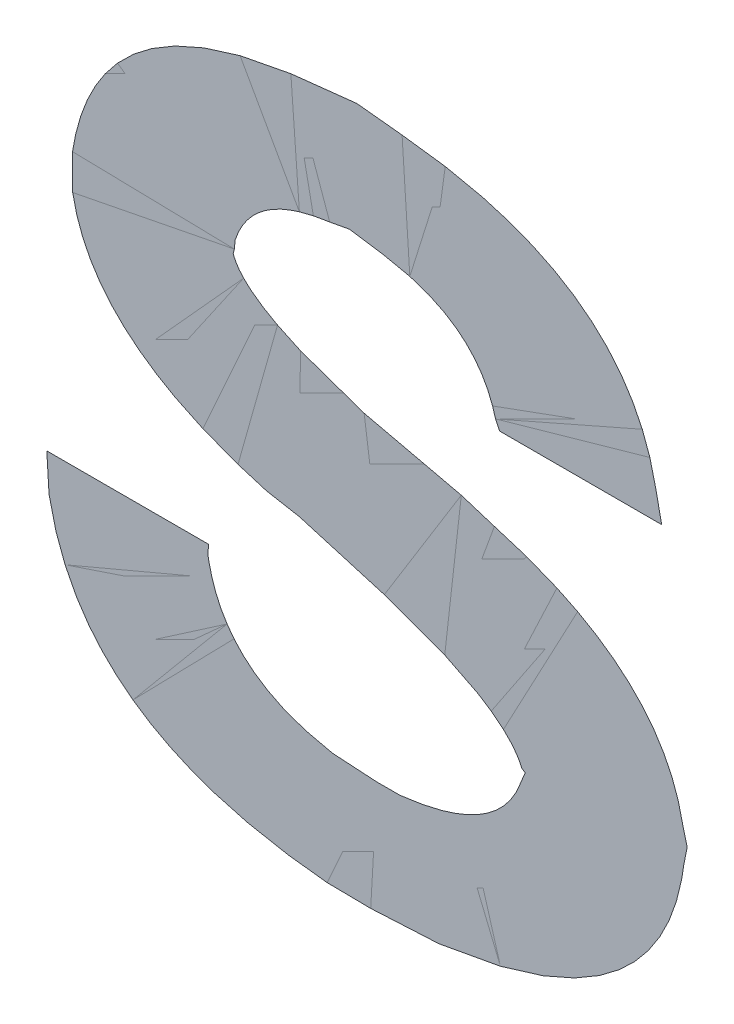
ISO-10303-21;
HEADER;
FILE_DESCRIPTION(('STEP AP214'),'2;1');
FILE_NAME('part.step','',(''),(''),'','','');
FILE_SCHEMA(('AUTOMOTIVE_DESIGN { 1 0 10303 214 1 1 1 1 }'));
ENDSEC;
DATA;
#1=APPLICATION_CONTEXT('core data for automotive mechanical design processes');
#2=APPLICATION_PROTOCOL_DEFINITION('international standard','automotive_design',2000,#1);
#3=PRODUCT_CONTEXT('',#1,'mechanical');
#4=PRODUCT('Part','Part','',(#3));
#5=PRODUCT_RELATED_PRODUCT_CATEGORY('part','',(#4));
#6=PRODUCT_DEFINITION_FORMATION('','',#4);
#7=PRODUCT_DEFINITION_CONTEXT('part definition',#1,'design');
#8=PRODUCT_DEFINITION('design','',#6,#7);
#9=PRODUCT_DEFINITION_SHAPE('','',#8);
#10=(LENGTH_UNIT() NAMED_UNIT(*) SI_UNIT(.MILLI.,.METRE.));
#11=(NAMED_UNIT(*) PLANE_ANGLE_UNIT() SI_UNIT($,.RADIAN.));
#12=(NAMED_UNIT(*) SI_UNIT($,.STERADIAN.) SOLID_ANGLE_UNIT());
#13=UNCERTAINTY_MEASURE_WITH_UNIT(LENGTH_MEASURE(1.E-05),#10,'distance_accuracy_value','');
#14=(GEOMETRIC_REPRESENTATION_CONTEXT(3) GLOBAL_UNCERTAINTY_ASSIGNED_CONTEXT((#13)) GLOBAL_UNIT_ASSIGNED_CONTEXT((#10,
#11,#12)) REPRESENTATION_CONTEXT('',''));
#15=CARTESIAN_POINT('',(0.,0.,0.));
#16=DIRECTION('',(0.,0.,1.));
#17=DIRECTION('',(1.,0.,0.));
#18=AXIS2_PLACEMENT_3D('',#15,#16,#17);
#19=CARTESIAN_POINT('',(-0.06689593975735,0.899067113092,0.));
#20=DIRECTION('',(0.,0.,1.));
#21=DIRECTION('',(1.,0.,0.));
#22=AXIS2_PLACEMENT_3D('',#19,#20,#21);
#23=PLANE('',#22);
#24=CARTESIAN_POINT('',(-0.06054561908235,0.906830798564,0.00015));
#25=CARTESIAN_POINT('',(-0.0612955167170538,0.903800439107508,0.00015));
#26=CARTESIAN_POINT('',(-0.066450327449,0.90355574771,0.00015));
#27=B_SPLINE_CURVE_WITH_KNOTS('',2,(#24,#25,#26),.UNSPECIFIED.,.F.,.F.,(3,3),(0.,1.),.UNSPECIFIED.);
#28=CARTESIAN_POINT('',(-0.06054561908235,0.906830798564,7.5E-05));
#29=VERTEX_POINT('',#28);
#30=CARTESIAN_POINT('',(-0.066450327449,0.90355574771,7.5E-05));
#31=VERTEX_POINT('',#30);
#32=EDGE_CURVE('E11',#29,#31,#27,.T.);
#33=ORIENTED_EDGE('',*,*,#32,.F.);
#34=CARTESIAN_POINT('',(-0.069551330899,0.911171798475,0.00015));
#35=CARTESIAN_POINT('',(-0.0612926902084211,0.909266054957949,0.00015));
#36=CARTESIAN_POINT('',(-0.06054561908235,0.906830798564,0.00015));
#37=B_SPLINE_CURVE_WITH_KNOTS('',2,(#34,#35,#36),.UNSPECIFIED.,.F.,.F.,(3,3),(0.,1.),.UNSPECIFIED.);
#38=CARTESIAN_POINT('',(-0.069551330899,0.911171798475,7.5E-05));
#39=VERTEX_POINT('',#38);
#40=EDGE_CURVE('E28',#39,#29,#37,.T.);
#41=ORIENTED_EDGE('',*,*,#40,.F.);
#42=CARTESIAN_POINT('',(-0.07860174036565,0.91863479663,0.00015));
#43=CARTESIAN_POINT('',(-0.078207940322684,0.913149856591779,0.00015));
#44=CARTESIAN_POINT('',(-0.069551330899,0.911171798475,0.00015));
#45=B_SPLINE_CURVE_WITH_KNOTS('',2,(#42,#43,#44),.UNSPECIFIED.,.F.,.F.,(3,3),(0.,1.),.UNSPECIFIED.);
#46=CARTESIAN_POINT('',(-0.07860174036565,0.91863479663,7.5E-05));
#47=VERTEX_POINT('',#46);
#48=EDGE_CURVE('E195',#47,#39,#45,.T.);
#49=ORIENTED_EDGE('',*,*,#48,.F.);
#50=CARTESIAN_POINT('',(-0.06725825276565,0.92658539668,0.00015));
#51=CARTESIAN_POINT('',(-0.0779681531074278,0.926204116962359,0.00015));
#52=CARTESIAN_POINT('',(-0.07860174036565,0.91863479663,0.00015));
#53=B_SPLINE_CURVE_WITH_KNOTS('',2,(#50,#51,#52),.UNSPECIFIED.,.F.,.F.,(3,3),(0.,1.),.UNSPECIFIED.);
#54=CARTESIAN_POINT('',(-0.06725825276565,0.92658539668,7.5E-05));
#55=VERTEX_POINT('',#54);
#56=EDGE_CURVE('E193',#55,#47,#53,.T.);
#57=ORIENTED_EDGE('',*,*,#56,.F.);
#58=CARTESIAN_POINT('',(-0.05510616251565,0.918120107117,0.00015));
#59=CARTESIAN_POINT('',(-0.0557102266318209,0.926247313697529,0.00015));
#60=CARTESIAN_POINT('',(-0.06725825276565,0.92658539668,0.00015));
#61=B_SPLINE_CURVE_WITH_KNOTS('',2,(#58,#59,#60),.UNSPECIFIED.,.F.,.F.,(3,3),(0.,1.),.UNSPECIFIED.);
#62=CARTESIAN_POINT('',(-0.05510616251565,0.918120107117,7.5E-05));
#63=VERTEX_POINT('',#62);
#64=EDGE_CURVE('E191',#63,#55,#61,.T.);
#65=ORIENTED_EDGE('',*,*,#64,.F.);
#66=CARTESIAN_POINT('',(-0.06156483853235,0.918120107117,0.00015));
#67=DIRECTION('',(1.,0.,0.));
#68=VECTOR('',#67,1.);
#69=LINE('',#66,#68);
#70=CARTESIAN_POINT('',(-0.06156483853235,0.918120107117,7.5E-05));
#71=VERTEX_POINT('',#70);
#72=EDGE_CURVE('E163',#71,#63,#69,.T.);
#73=ORIENTED_EDGE('',*,*,#72,.F.);
#74=CARTESIAN_POINT('',(-0.067556230749,0.922095406719,0.00015));
#75=CARTESIAN_POINT('',(-0.0622261221650718,0.921906047657782,0.00015));
#76=CARTESIAN_POINT('',(-0.06156483853235,0.918120107117,0.00015));
#77=B_SPLINE_CURVE_WITH_KNOTS('',2,(#74,#75,#76),.UNSPECIFIED.,.F.,.F.,(3,3),(0.,1.),.UNSPECIFIED.);
#78=CARTESIAN_POINT('',(-0.067556230749,0.922095406719,7.5E-05));
#79=VERTEX_POINT('',#78);
#80=EDGE_CURVE('E190',#79,#71,#77,.T.);
#81=ORIENTED_EDGE('',*,*,#80,.F.);
#82=CARTESIAN_POINT('',(-0.07214374168235,0.919115625192,0.00015));
#83=CARTESIAN_POINT('',(-0.0715850767061946,0.921829000531209,0.00015));
#84=CARTESIAN_POINT('',(-0.067556230749,0.922095406719,0.00015));
#85=B_SPLINE_CURVE_WITH_KNOTS('',2,(#82,#83,#84),.UNSPECIFIED.,.F.,.F.,(3,3),(0.,1.),.UNSPECIFIED.);
#86=CARTESIAN_POINT('',(-0.07214374168235,0.919115625192,7.5E-05));
#87=VERTEX_POINT('',#86);
#88=EDGE_CURVE('E188',#87,#79,#85,.T.);
#89=ORIENTED_EDGE('',*,*,#88,.F.);
#90=CARTESIAN_POINT('',(-0.063094009549,0.91514032559,0.00015));
#91=CARTESIAN_POINT('',(-0.0716430528753564,0.917043327001878,0.00015));
#92=CARTESIAN_POINT('',(-0.07214374168235,0.919115625192,0.00015));
#93=B_SPLINE_CURVE_WITH_KNOTS('',2,(#90,#91,#92),.UNSPECIFIED.,.F.,.F.,(3,3),(0.,1.),.UNSPECIFIED.);
#94=CARTESIAN_POINT('',(-0.063094009549,0.91514032559,7.5E-05));
#95=VERTEX_POINT('',#94);
#96=EDGE_CURVE('E186',#95,#87,#93,.T.);
#97=ORIENTED_EDGE('',*,*,#96,.F.);
#98=CARTESIAN_POINT('',(-0.05408626573235,0.907494477069,0.00015));
#99=CARTESIAN_POINT('',(-0.05459859129716,0.913317274620205,0.00015));
#100=CARTESIAN_POINT('',(-0.063094009549,0.91514032559,0.00015));
#101=B_SPLINE_CURVE_WITH_KNOTS('',2,(#98,#99,#100),.UNSPECIFIED.,.F.,.F.,(3,3),(0.,1.),.UNSPECIFIED.);
#102=CARTESIAN_POINT('',(-0.05408626573235,0.907494477069,7.5E-05));
#103=VERTEX_POINT('',#102);
#104=EDGE_CURVE('E184',#103,#95,#101,.T.);
#105=ORIENTED_EDGE('',*,*,#104,.F.);
#106=CARTESIAN_POINT('',(-0.06670631711565,0.899067113092,0.00015));
#107=CARTESIAN_POINT('',(-0.0546468477495528,0.899474139015626,0.00015));
#108=CARTESIAN_POINT('',(-0.05408626573235,0.907494477069,0.00015));
#109=B_SPLINE_CURVE_WITH_KNOTS('',2,(#106,#107,#108),.UNSPECIFIED.,.F.,.F.,(3,3),(0.,1.),.UNSPECIFIED.);
#110=CARTESIAN_POINT('',(-0.06670631711565,0.899067113092,7.5E-05));
#111=VERTEX_POINT('',#110);
#112=EDGE_CURVE('E183',#111,#103,#109,.T.);
#113=ORIENTED_EDGE('',*,*,#112,.F.);
#114=CARTESIAN_POINT('',(-0.07962095981565,0.908408728267,0.00015));
#115=CARTESIAN_POINT('',(-0.0790641932267371,0.899472298045532,0.00015));
#116=CARTESIAN_POINT('',(-0.06670631711565,0.899067113092,0.00015));
#117=B_SPLINE_CURVE_WITH_KNOTS('',2,(#114,#115,#116),.UNSPECIFIED.,.F.,.F.,(3,3),(0.,1.),.UNSPECIFIED.);
#118=CARTESIAN_POINT('',(-0.07962095981565,0.908408728267,7.5E-05));
#119=VERTEX_POINT('',#118);
#120=EDGE_CURVE('E182',#119,#111,#117,.T.);
#121=ORIENTED_EDGE('',*,*,#120,.F.);
#122=CARTESIAN_POINT('',(-0.07316363846565,0.908408728267,0.00015));
#123=DIRECTION('',(-1.,0.,0.));
#124=VECTOR('',#123,1.);
#125=LINE('',#122,#124);
#126=CARTESIAN_POINT('',(-0.07316363846565,0.908408728267,7.5E-05));
#127=VERTEX_POINT('',#126);
#128=EDGE_CURVE('E71',#127,#119,#125,.T.);
#129=ORIENTED_EDGE('',*,*,#128,.F.);
#130=CARTESIAN_POINT('',(-0.066450327449,0.90355574771,0.00015));
#131=CARTESIAN_POINT('',(-0.0726274294403161,0.903864768251856,0.00015));
#132=CARTESIAN_POINT('',(-0.07316363846565,0.908408728267,0.00015));
#133=B_SPLINE_CURVE_WITH_KNOTS('',2,(#130,#131,#132),.UNSPECIFIED.,.F.,.F.,(3,3),(0.,1.),.UNSPECIFIED.);
#134=EDGE_CURVE('E73',#31,#127,#133,.T.);
#135=ORIENTED_EDGE('',*,*,#134,.F.);
#136=EDGE_LOOP('',(#33,#41,#49,#57,#65,#73,#81,#89,#97,#105,#113,#121,#129,#135));
#137=FACE_BOUND('',#136,.T.);
#138=ADVANCED_FACE('F17',(#137),#23,.F.);
#139=CARTESIAN_POINT('',(-0.06689593975735,0.899067113092,0.00015));
#140=DIRECTION('',(0.,0.,1.));
#141=DIRECTION('',(1.,0.,0.));
#142=AXIS2_PLACEMENT_3D('',#139,#140,#141);
#143=PLANE('',#142);
#144=ORIENTED_EDGE('',*,*,#40,.T.);
#145=ORIENTED_EDGE('',*,*,#32,.T.);
#146=ORIENTED_EDGE('',*,*,#134,.T.);
#147=ORIENTED_EDGE('',*,*,#128,.T.);
#148=ORIENTED_EDGE('',*,*,#120,.T.);
#149=ORIENTED_EDGE('',*,*,#112,.T.);
#150=ORIENTED_EDGE('',*,*,#104,.T.);
#151=ORIENTED_EDGE('',*,*,#96,.T.);
#152=ORIENTED_EDGE('',*,*,#88,.T.);
#153=ORIENTED_EDGE('',*,*,#80,.T.);
#154=ORIENTED_EDGE('',*,*,#72,.T.);
#155=ORIENTED_EDGE('',*,*,#64,.T.);
#156=ORIENTED_EDGE('',*,*,#56,.T.);
#157=ORIENTED_EDGE('',*,*,#48,.T.);
#158=EDGE_LOOP('',(#144,#145,#146,#147,#148,#149,#150,#151,#152,#153,#154,#155,#156,#157));
#159=FACE_BOUND('',#158,.T.);
#160=ADVANCED_FACE('F80',(#159),#143,.T.);
#161=CLOSED_SHELL('',(#138,#160));
#162=MANIFOLD_SOLID_BREP('B1',#161);
#163=ADVANCED_BREP_SHAPE_REPRESENTATION('',(#18,#162),#14);
#164=SHAPE_DEFINITION_REPRESENTATION(#9,#163);
ENDSEC;
END-ISO-10303-21;
